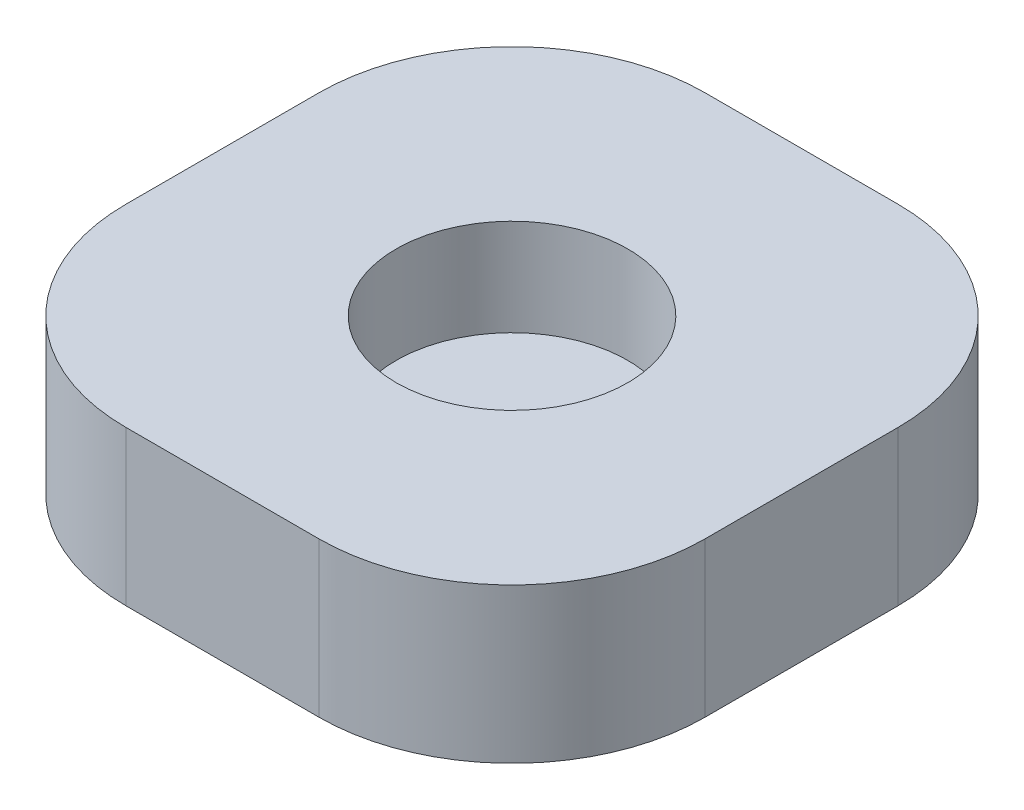
ISO-10303-21;
HEADER;
FILE_DESCRIPTION(('STEP AP214'),'2;1');
FILE_NAME('part.step','',(''),(''),'','','');
FILE_SCHEMA(('AUTOMOTIVE_DESIGN { 1 0 10303 214 1 1 1 1 }'));
ENDSEC;
DATA;
#1=APPLICATION_CONTEXT('core data for automotive mechanical design processes');
#2=APPLICATION_PROTOCOL_DEFINITION('international standard','automotive_design',2000,#1);
#3=PRODUCT_CONTEXT('',#1,'mechanical');
#4=PRODUCT('Part','Part','',(#3));
#5=PRODUCT_RELATED_PRODUCT_CATEGORY('part','',(#4));
#6=PRODUCT_DEFINITION_FORMATION('','',#4);
#7=PRODUCT_DEFINITION_CONTEXT('part definition',#1,'design');
#8=PRODUCT_DEFINITION('design','',#6,#7);
#9=PRODUCT_DEFINITION_SHAPE('','',#8);
#10=(LENGTH_UNIT() NAMED_UNIT(*) SI_UNIT(.MILLI.,.METRE.));
#11=(NAMED_UNIT(*) PLANE_ANGLE_UNIT() SI_UNIT($,.RADIAN.));
#12=(NAMED_UNIT(*) SI_UNIT($,.STERADIAN.) SOLID_ANGLE_UNIT());
#13=UNCERTAINTY_MEASURE_WITH_UNIT(LENGTH_MEASURE(1.E-05),#10,'distance_accuracy_value','');
#14=(GEOMETRIC_REPRESENTATION_CONTEXT(3) GLOBAL_UNCERTAINTY_ASSIGNED_CONTEXT((#13)) GLOBAL_UNIT_ASSIGNED_CONTEXT((#10,
#11,#12)) REPRESENTATION_CONTEXT('',''));
#15=CARTESIAN_POINT('',(0.,0.,0.));
#16=DIRECTION('',(0.,0.,1.));
#17=DIRECTION('',(1.,0.,0.));
#18=AXIS2_PLACEMENT_3D('',#15,#16,#17);
#19=CARTESIAN_POINT('',(2.5,4.,2.5));
#20=DIRECTION('',(0.,-1.,0.));
#21=DIRECTION('',(0.,0.,-1.));
#22=AXIS2_PLACEMENT_3D('',#19,#20,#21);
#23=CYLINDRICAL_SURFACE('',#22,5.);
#24=CARTESIAN_POINT('',(2.5,0.,2.5));
#25=DIRECTION('',(0.,1.,0.));
#26=DIRECTION('',(0.,0.,1.));
#27=AXIS2_PLACEMENT_3D('',#24,#25,#26);
#28=CIRCLE('',#27,5.);
#29=CARTESIAN_POINT('',(2.5,0.,7.5));
#30=VERTEX_POINT('',#29);
#31=CARTESIAN_POINT('',(7.5,0.,2.5));
#32=VERTEX_POINT('',#31);
#33=EDGE_CURVE('E140',#30,#32,#28,.T.);
#34=ORIENTED_EDGE('',*,*,#33,.T.);
#35=DIRECTION('',(0.,-1.,0.));
#36=VECTOR('',#35,1.);
#37=CARTESIAN_POINT('',(7.5,4.,2.5));
#38=LINE('',#37,#36);
#39=CARTESIAN_POINT('',(7.5,4.,2.5));
#40=VERTEX_POINT('',#39);
#41=EDGE_CURVE('E11',#40,#32,#38,.T.);
#42=ORIENTED_EDGE('',*,*,#41,.F.);
#43=CARTESIAN_POINT('',(2.5,4.,2.5));
#44=DIRECTION('',(0.,1.,0.));
#45=DIRECTION('',(0.,0.,1.));
#46=AXIS2_PLACEMENT_3D('',#43,#44,#45);
#47=CIRCLE('',#46,5.);
#48=CARTESIAN_POINT('',(2.5,4.,7.5));
#49=VERTEX_POINT('',#48);
#50=EDGE_CURVE('E163',#49,#40,#47,.T.);
#51=ORIENTED_EDGE('',*,*,#50,.F.);
#52=DIRECTION('',(0.,-1.,0.));
#53=VECTOR('',#52,1.);
#54=CARTESIAN_POINT('',(2.5,4.,7.5));
#55=LINE('',#54,#53);
#56=EDGE_CURVE('E136',#49,#30,#55,.T.);
#57=ORIENTED_EDGE('',*,*,#56,.T.);
#58=EDGE_LOOP('',(#34,#42,#51,#57));
#59=FACE_BOUND('',#58,.T.);
#60=ADVANCED_FACE('F39',(#59),#23,.T.);
#61=CARTESIAN_POINT('',(7.5,4.,2.5));
#62=DIRECTION('',(-1.,0.,0.));
#63=DIRECTION('',(0.,0.,1.));
#64=AXIS2_PLACEMENT_3D('',#61,#62,#63);
#65=PLANE('',#64);
#66=DIRECTION('',(0.,0.,-1.));
#67=VECTOR('',#66,1.);
#68=CARTESIAN_POINT('',(7.5,0.,2.5));
#69=LINE('',#68,#67);
#70=CARTESIAN_POINT('',(7.5,0.,-2.5));
#71=VERTEX_POINT('',#70);
#72=EDGE_CURVE('E144',#32,#71,#69,.T.);
#73=ORIENTED_EDGE('',*,*,#72,.T.);
#74=DIRECTION('',(0.,-1.,0.));
#75=VECTOR('',#74,1.);
#76=CARTESIAN_POINT('',(7.5,4.,-2.5));
#77=LINE('',#76,#75);
#78=CARTESIAN_POINT('',(7.5,4.,-2.5));
#79=VERTEX_POINT('',#78);
#80=EDGE_CURVE('E48',#79,#71,#77,.T.);
#81=ORIENTED_EDGE('',*,*,#80,.F.);
#82=DIRECTION('',(0.,0.,-1.));
#83=VECTOR('',#82,1.);
#84=CARTESIAN_POINT('',(7.5,4.,2.5));
#85=LINE('',#84,#83);
#86=EDGE_CURVE('E99',#40,#79,#85,.T.);
#87=ORIENTED_EDGE('',*,*,#86,.F.);
#88=ORIENTED_EDGE('',*,*,#41,.T.);
#89=EDGE_LOOP('',(#73,#81,#87,#88));
#90=FACE_BOUND('',#89,.T.);
#91=ADVANCED_FACE('F233',(#90),#65,.F.);
#92=CARTESIAN_POINT('',(2.5,4.,-2.5));
#93=DIRECTION('',(0.,-1.,0.));
#94=DIRECTION('',(0.,0.,-1.));
#95=AXIS2_PLACEMENT_3D('',#92,#93,#94);
#96=CYLINDRICAL_SURFACE('',#95,5.);
#97=CARTESIAN_POINT('',(2.5,0.,-2.5));
#98=DIRECTION('',(0.,1.,0.));
#99=DIRECTION('',(0.,0.,-1.));
#100=AXIS2_PLACEMENT_3D('',#97,#98,#99);
#101=CIRCLE('',#100,5.);
#102=CARTESIAN_POINT('',(2.5,0.,-7.5));
#103=VERTEX_POINT('',#102);
#104=EDGE_CURVE('E148',#71,#103,#101,.T.);
#105=ORIENTED_EDGE('',*,*,#104,.T.);
#106=DIRECTION('',(0.,-1.,0.));
#107=VECTOR('',#106,1.);
#108=CARTESIAN_POINT('',(2.5,4.,-7.5));
#109=LINE('',#108,#107);
#110=CARTESIAN_POINT('',(2.5,4.,-7.5));
#111=VERTEX_POINT('',#110);
#112=EDGE_CURVE('E174',#111,#103,#109,.T.);
#113=ORIENTED_EDGE('',*,*,#112,.F.);
#114=CARTESIAN_POINT('',(2.5,4.,-2.5));
#115=DIRECTION('',(0.,1.,0.));
#116=DIRECTION('',(0.,0.,-1.));
#117=AXIS2_PLACEMENT_3D('',#114,#115,#116);
#118=CIRCLE('',#117,5.);
#119=EDGE_CURVE('E184',#79,#111,#118,.T.);
#120=ORIENTED_EDGE('',*,*,#119,.F.);
#121=ORIENTED_EDGE('',*,*,#80,.T.);
#122=EDGE_LOOP('',(#105,#113,#120,#121));
#123=FACE_BOUND('',#122,.T.);
#124=ADVANCED_FACE('F182',(#123),#96,.T.);
#125=CARTESIAN_POINT('',(-2.5,4.,-7.5));
#126=DIRECTION('',(0.,0.,1.));
#127=DIRECTION('',(1.,0.,0.));
#128=AXIS2_PLACEMENT_3D('',#125,#126,#127);
#129=PLANE('',#128);
#130=DIRECTION('',(-1.,0.,0.));
#131=VECTOR('',#130,1.);
#132=CARTESIAN_POINT('',(-2.5,0.,-7.5));
#133=LINE('',#132,#131);
#134=CARTESIAN_POINT('',(-2.5,0.,-7.5));
#135=VERTEX_POINT('',#134);
#136=EDGE_CURVE('E151',#103,#135,#133,.T.);
#137=ORIENTED_EDGE('',*,*,#136,.T.);
#138=DIRECTION('',(0.,-1.,0.));
#139=VECTOR('',#138,1.);
#140=CARTESIAN_POINT('',(-2.5,4.,-7.5));
#141=LINE('',#140,#139);
#142=CARTESIAN_POINT('',(-2.5,4.,-7.5));
#143=VERTEX_POINT('',#142);
#144=EDGE_CURVE('E170',#143,#135,#141,.T.);
#145=ORIENTED_EDGE('',*,*,#144,.F.);
#146=DIRECTION('',(-1.,0.,0.));
#147=VECTOR('',#146,1.);
#148=CARTESIAN_POINT('',(-2.5,4.,-7.5));
#149=LINE('',#148,#147);
#150=EDGE_CURVE('E197',#111,#143,#149,.T.);
#151=ORIENTED_EDGE('',*,*,#150,.F.);
#152=ORIENTED_EDGE('',*,*,#112,.T.);
#153=EDGE_LOOP('',(#137,#145,#151,#152));
#154=FACE_BOUND('',#153,.T.);
#155=ADVANCED_FACE('F192',(#154),#129,.F.);
#156=CARTESIAN_POINT('',(-2.5,4.,-2.5));
#157=DIRECTION('',(0.,-1.,0.));
#158=DIRECTION('',(0.,0.,-1.));
#159=AXIS2_PLACEMENT_3D('',#156,#157,#158);
#160=CYLINDRICAL_SURFACE('',#159,5.);
#161=CARTESIAN_POINT('',(-2.5,0.,-2.5));
#162=DIRECTION('',(0.,1.,0.));
#163=DIRECTION('',(0.,0.,-1.));
#164=AXIS2_PLACEMENT_3D('',#161,#162,#163);
#165=CIRCLE('',#164,5.);
#166=CARTESIAN_POINT('',(-7.5,0.,-2.5));
#167=VERTEX_POINT('',#166);
#168=EDGE_CURVE('E154',#135,#167,#165,.T.);
#169=ORIENTED_EDGE('',*,*,#168,.T.);
#170=DIRECTION('',(0.,-1.,0.));
#171=VECTOR('',#170,1.);
#172=CARTESIAN_POINT('',(-7.5,4.,-2.5));
#173=LINE('',#172,#171);
#174=CARTESIAN_POINT('',(-7.5,4.,-2.5));
#175=VERTEX_POINT('',#174);
#176=EDGE_CURVE('E129',#175,#167,#173,.T.);
#177=ORIENTED_EDGE('',*,*,#176,.F.);
#178=CARTESIAN_POINT('',(-2.5,4.,-2.5));
#179=DIRECTION('',(0.,1.,0.));
#180=DIRECTION('',(0.,0.,-1.));
#181=AXIS2_PLACEMENT_3D('',#178,#179,#180);
#182=CIRCLE('',#181,5.);
#183=EDGE_CURVE('E118',#143,#175,#182,.T.);
#184=ORIENTED_EDGE('',*,*,#183,.F.);
#185=ORIENTED_EDGE('',*,*,#144,.T.);
#186=EDGE_LOOP('',(#169,#177,#184,#185));
#187=FACE_BOUND('',#186,.T.);
#188=ADVANCED_FACE('F195',(#187),#160,.T.);
#189=CARTESIAN_POINT('',(-7.5,4.,2.5));
#190=DIRECTION('',(1.,0.,0.));
#191=DIRECTION('',(0.,0.,-1.));
#192=AXIS2_PLACEMENT_3D('',#189,#190,#191);
#193=PLANE('',#192);
#194=DIRECTION('',(0.,0.,1.));
#195=VECTOR('',#194,1.);
#196=CARTESIAN_POINT('',(-7.5,0.,2.5));
#197=LINE('',#196,#195);
#198=CARTESIAN_POINT('',(-7.5,0.,2.5));
#199=VERTEX_POINT('',#198);
#200=EDGE_CURVE('E127',#167,#199,#197,.T.);
#201=ORIENTED_EDGE('',*,*,#200,.T.);
#202=DIRECTION('',(0.,-1.,0.));
#203=VECTOR('',#202,1.);
#204=CARTESIAN_POINT('',(-7.5,4.,2.5));
#205=LINE('',#204,#203);
#206=CARTESIAN_POINT('',(-7.5,4.,2.5));
#207=VERTEX_POINT('',#206);
#208=EDGE_CURVE('E124',#207,#199,#205,.T.);
#209=ORIENTED_EDGE('',*,*,#208,.F.);
#210=DIRECTION('',(0.,0.,1.));
#211=VECTOR('',#210,1.);
#212=CARTESIAN_POINT('',(-7.5,4.,2.5));
#213=LINE('',#212,#211);
#214=EDGE_CURVE('E112',#175,#207,#213,.T.);
#215=ORIENTED_EDGE('',*,*,#214,.F.);
#216=ORIENTED_EDGE('',*,*,#176,.T.);
#217=EDGE_LOOP('',(#201,#209,#215,#216));
#218=FACE_BOUND('',#217,.T.);
#219=ADVANCED_FACE('F125',(#218),#193,.F.);
#220=CARTESIAN_POINT('',(-2.5,4.,2.5));
#221=DIRECTION('',(0.,-1.,0.));
#222=DIRECTION('',(0.,0.,-1.));
#223=AXIS2_PLACEMENT_3D('',#220,#221,#222);
#224=CYLINDRICAL_SURFACE('',#223,5.);
#225=CARTESIAN_POINT('',(-2.5,0.,2.5));
#226=DIRECTION('',(0.,1.,0.));
#227=DIRECTION('',(0.,0.,-1.));
#228=AXIS2_PLACEMENT_3D('',#225,#226,#227);
#229=CIRCLE('',#228,5.);
#230=CARTESIAN_POINT('',(-2.5,0.,7.5));
#231=VERTEX_POINT('',#230);
#232=EDGE_CURVE('E85',#199,#231,#229,.T.);
#233=ORIENTED_EDGE('',*,*,#232,.T.);
#234=DIRECTION('',(0.,-1.,0.));
#235=VECTOR('',#234,1.);
#236=CARTESIAN_POINT('',(-2.5,4.,7.5));
#237=LINE('',#236,#235);
#238=CARTESIAN_POINT('',(-2.5,4.,7.5));
#239=VERTEX_POINT('',#238);
#240=EDGE_CURVE('E130',#239,#231,#237,.T.);
#241=ORIENTED_EDGE('',*,*,#240,.F.);
#242=CARTESIAN_POINT('',(-2.5,4.,2.5));
#243=DIRECTION('',(0.,1.,0.));
#244=DIRECTION('',(0.,0.,-1.));
#245=AXIS2_PLACEMENT_3D('',#242,#243,#244);
#246=CIRCLE('',#245,5.);
#247=EDGE_CURVE('E116',#207,#239,#246,.T.);
#248=ORIENTED_EDGE('',*,*,#247,.F.);
#249=ORIENTED_EDGE('',*,*,#208,.T.);
#250=EDGE_LOOP('',(#233,#241,#248,#249));
#251=FACE_BOUND('',#250,.T.);
#252=ADVANCED_FACE('F132',(#251),#224,.T.);
#253=CARTESIAN_POINT('',(-2.5,4.,7.5));
#254=DIRECTION('',(0.,0.,-1.));
#255=DIRECTION('',(-1.,0.,0.));
#256=AXIS2_PLACEMENT_3D('',#253,#254,#255);
#257=PLANE('',#256);
#258=DIRECTION('',(1.,0.,0.));
#259=VECTOR('',#258,1.);
#260=CARTESIAN_POINT('',(-2.5,0.,7.5));
#261=LINE('',#260,#259);
#262=EDGE_CURVE('E91',#231,#30,#261,.T.);
#263=ORIENTED_EDGE('',*,*,#262,.T.);
#264=ORIENTED_EDGE('',*,*,#56,.F.);
#265=DIRECTION('',(1.,0.,0.));
#266=VECTOR('',#265,1.);
#267=CARTESIAN_POINT('',(-2.5,4.,7.5));
#268=LINE('',#267,#266);
#269=EDGE_CURVE('E56',#239,#49,#268,.T.);
#270=ORIENTED_EDGE('',*,*,#269,.F.);
#271=ORIENTED_EDGE('',*,*,#240,.T.);
#272=EDGE_LOOP('',(#263,#264,#270,#271));
#273=FACE_BOUND('',#272,.T.);
#274=ADVANCED_FACE('F224',(#273),#257,.F.);
#275=CARTESIAN_POINT('',(2.5,4.,2.5));
#276=DIRECTION('',(0.,1.,0.));
#277=DIRECTION('',(0.,0.,1.));
#278=AXIS2_PLACEMENT_3D('',#275,#276,#277);
#279=PLANE('',#278);
#280=CARTESIAN_POINT('',(0.,4.,0.));
#281=DIRECTION('',(0.,1.,0.));
#282=DIRECTION('',(0.,0.,1.));
#283=AXIS2_PLACEMENT_3D('',#280,#281,#282);
#284=CIRCLE('',#283,3.);
#285=CARTESIAN_POINT('',(0.,4.,3.));
#286=VERTEX_POINT('',#285);
#287=EDGE_CURVE('E207',#286,#286,#284,.T.);
#288=ORIENTED_EDGE('',*,*,#287,.F.);
#289=EDGE_LOOP('',(#288));
#290=FACE_BOUND('',#289,.T.);
#291=ORIENTED_EDGE('',*,*,#50,.T.);
#292=ORIENTED_EDGE('',*,*,#86,.T.);
#293=ORIENTED_EDGE('',*,*,#119,.T.);
#294=ORIENTED_EDGE('',*,*,#150,.T.);
#295=ORIENTED_EDGE('',*,*,#183,.T.);
#296=ORIENTED_EDGE('',*,*,#214,.T.);
#297=ORIENTED_EDGE('',*,*,#247,.T.);
#298=ORIENTED_EDGE('',*,*,#269,.T.);
#299=EDGE_LOOP('',(#291,#292,#293,#294,#295,#296,#297,#298));
#300=FACE_BOUND('',#299,.T.);
#301=ADVANCED_FACE('F114',(#290,#300),#279,.T.);
#302=CARTESIAN_POINT('',(2.5,0.,2.5));
#303=DIRECTION('',(0.,1.,0.));
#304=DIRECTION('',(0.,0.,1.));
#305=AXIS2_PLACEMENT_3D('',#302,#303,#304);
#306=PLANE('',#305);
#307=ORIENTED_EDGE('',*,*,#33,.F.);
#308=ORIENTED_EDGE('',*,*,#262,.F.);
#309=ORIENTED_EDGE('',*,*,#232,.F.);
#310=ORIENTED_EDGE('',*,*,#200,.F.);
#311=ORIENTED_EDGE('',*,*,#168,.F.);
#312=ORIENTED_EDGE('',*,*,#136,.F.);
#313=ORIENTED_EDGE('',*,*,#104,.F.);
#314=ORIENTED_EDGE('',*,*,#72,.F.);
#315=EDGE_LOOP('',(#307,#308,#309,#310,#311,#312,#313,#314));
#316=FACE_BOUND('',#315,.T.);
#317=ADVANCED_FACE('F188',(#316),#306,.F.);
#318=CARTESIAN_POINT('',(0.,1.5,0.));
#319=DIRECTION('',(0.,1.,0.));
#320=DIRECTION('',(0.,0.,1.));
#321=AXIS2_PLACEMENT_3D('',#318,#319,#320);
#322=CYLINDRICAL_SURFACE('',#321,3.);
#323=CARTESIAN_POINT('',(0.,1.5,0.));
#324=DIRECTION('',(0.,1.,0.));
#325=DIRECTION('',(0.,0.,1.));
#326=AXIS2_PLACEMENT_3D('',#323,#324,#325);
#327=CIRCLE('',#326,3.);
#328=CARTESIAN_POINT('',(0.,1.5,3.));
#329=VERTEX_POINT('',#328);
#330=EDGE_CURVE('E145',#329,#329,#327,.T.);
#331=ORIENTED_EDGE('',*,*,#330,.F.);
#332=EDGE_LOOP('',(#331));
#333=FACE_BOUND('',#332,.T.);
#334=ORIENTED_EDGE('',*,*,#287,.T.);
#335=EDGE_LOOP('',(#334));
#336=FACE_BOUND('',#335,.T.);
#337=ADVANCED_FACE('F217',(#333,#336),#322,.F.);
#338=CARTESIAN_POINT('',(0.,1.5,0.));
#339=DIRECTION('',(0.,1.,0.));
#340=DIRECTION('',(0.,0.,1.));
#341=AXIS2_PLACEMENT_3D('',#338,#339,#340);
#342=PLANE('',#341);
#343=ORIENTED_EDGE('',*,*,#330,.T.);
#344=EDGE_LOOP('',(#343));
#345=FACE_BOUND('',#344,.T.);
#346=ADVANCED_FACE('F215',(#345),#342,.T.);
#347=CLOSED_SHELL('',(#60,#91,#124,#155,#188,#219,#252,#274,#301,#317,#337,#346));
#348=MANIFOLD_SOLID_BREP('B2',#347);
#349=ADVANCED_BREP_SHAPE_REPRESENTATION('',(#18,#348),#14);
#350=SHAPE_DEFINITION_REPRESENTATION(#9,#349);
ENDSEC;
END-ISO-10303-21;
